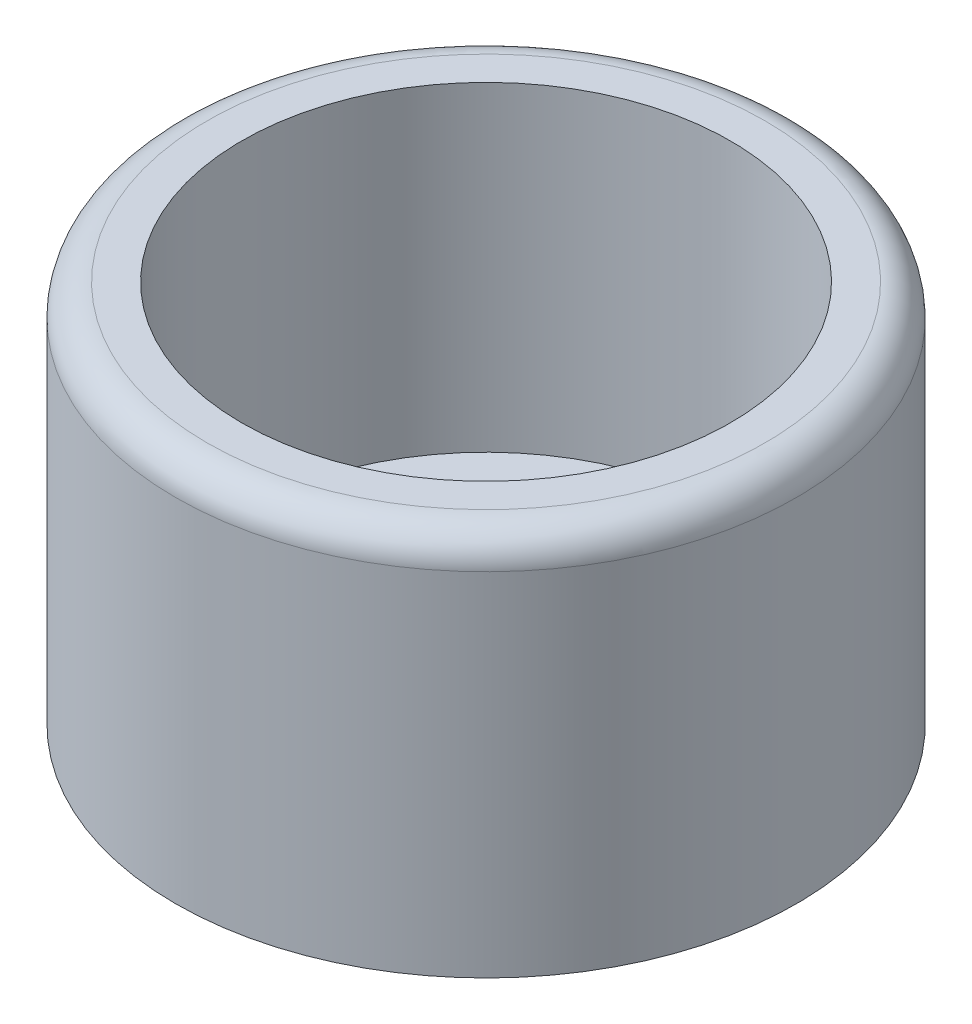
ISO-10303-21;
HEADER;
FILE_DESCRIPTION(('STEP AP214'),'2;1');
FILE_NAME('part.step','',(''),(''),'','','');
FILE_SCHEMA(('AUTOMOTIVE_DESIGN { 1 0 10303 214 1 1 1 1 }'));
ENDSEC;
DATA;
#1=APPLICATION_CONTEXT('core data for automotive mechanical design processes');
#2=APPLICATION_PROTOCOL_DEFINITION('international standard','automotive_design',2000,#1);
#3=PRODUCT_CONTEXT('',#1,'mechanical');
#4=PRODUCT('Part','Part','',(#3));
#5=PRODUCT_RELATED_PRODUCT_CATEGORY('part','',(#4));
#6=PRODUCT_DEFINITION_FORMATION('','',#4);
#7=PRODUCT_DEFINITION_CONTEXT('part definition',#1,'design');
#8=PRODUCT_DEFINITION('design','',#6,#7);
#9=PRODUCT_DEFINITION_SHAPE('','',#8);
#10=(LENGTH_UNIT() NAMED_UNIT(*) SI_UNIT(.MILLI.,.METRE.));
#11=(NAMED_UNIT(*) PLANE_ANGLE_UNIT() SI_UNIT($,.RADIAN.));
#12=(NAMED_UNIT(*) SI_UNIT($,.STERADIAN.) SOLID_ANGLE_UNIT());
#13=UNCERTAINTY_MEASURE_WITH_UNIT(LENGTH_MEASURE(1.E-05),#10,'distance_accuracy_value','');
#14=(GEOMETRIC_REPRESENTATION_CONTEXT(3) GLOBAL_UNCERTAINTY_ASSIGNED_CONTEXT((#13)) GLOBAL_UNIT_ASSIGNED_CONTEXT((#10,
#11,#12)) REPRESENTATION_CONTEXT('',''));
#15=CARTESIAN_POINT('',(0.,0.,0.));
#16=DIRECTION('',(0.,0.,1.));
#17=DIRECTION('',(1.,0.,0.));
#18=AXIS2_PLACEMENT_3D('',#15,#16,#17);
#19=CARTESIAN_POINT('',(0.,6.08,0.));
#20=DIRECTION('',(0.,-1.,0.));
#21=DIRECTION('',(0.,0.,-1.));
#22=AXIS2_PLACEMENT_3D('',#19,#20,#21);
#23=CYLINDRICAL_SURFACE('',#22,4.925);
#24=CARTESIAN_POINT('',(0.,5.58,0.));
#25=DIRECTION('',(0.,1.,0.));
#26=DIRECTION('',(0.,0.,1.));
#27=AXIS2_PLACEMENT_3D('',#24,#25,#26);
#28=CIRCLE('',#27,4.925);
#29=CARTESIAN_POINT('',(0.,5.58,4.925));
#30=VERTEX_POINT('',#29);
#31=EDGE_CURVE('E12',#30,#30,#28,.F.);
#32=ORIENTED_EDGE('',*,*,#31,.T.);
#33=EDGE_LOOP('',(#32));
#34=FACE_BOUND('',#33,.T.);
#35=CARTESIAN_POINT('',(0.,0.,0.));
#36=DIRECTION('',(0.,1.,0.));
#37=DIRECTION('',(0.,0.,1.));
#38=AXIS2_PLACEMENT_3D('',#35,#36,#37);
#39=CIRCLE('',#38,4.925);
#40=CARTESIAN_POINT('',(0.,0.,4.925));
#41=VERTEX_POINT('',#40);
#42=EDGE_CURVE('E233',#41,#41,#39,.T.);
#43=ORIENTED_EDGE('',*,*,#42,.T.);
#44=EDGE_LOOP('',(#43));
#45=FACE_BOUND('',#44,.T.);
#46=ADVANCED_FACE('F36',(#34,#45),#23,.T.);
#47=CARTESIAN_POINT('',(0.,6.08,0.));
#48=DIRECTION('',(0.,1.,0.));
#49=DIRECTION('',(0.,0.,1.));
#50=AXIS2_PLACEMENT_3D('',#47,#48,#49);
#51=PLANE('',#50);
#52=CARTESIAN_POINT('',(0.,6.08,0.));
#53=DIRECTION('',(0.,1.,0.));
#54=DIRECTION('',(0.,0.,1.));
#55=AXIS2_PLACEMENT_3D('',#52,#53,#54);
#56=CIRCLE('',#55,4.425);
#57=CARTESIAN_POINT('',(0.,6.08,4.425));
#58=VERTEX_POINT('',#57);
#59=EDGE_CURVE('E44',#58,#58,#56,.T.);
#60=ORIENTED_EDGE('',*,*,#59,.T.);
#61=EDGE_LOOP('',(#60));
#62=FACE_BOUND('',#61,.T.);
#63=CARTESIAN_POINT('',(0.,6.08,0.));
#64=DIRECTION('',(0.,1.,0.));
#65=DIRECTION('',(0.,0.,1.));
#66=AXIS2_PLACEMENT_3D('',#63,#64,#65);
#67=CIRCLE('',#66,3.875);
#68=CARTESIAN_POINT('',(0.,6.08,3.875));
#69=VERTEX_POINT('',#68);
#70=EDGE_CURVE('E208',#69,#69,#67,.T.);
#71=ORIENTED_EDGE('',*,*,#70,.F.);
#72=EDGE_LOOP('',(#71));
#73=FACE_BOUND('',#72,.T.);
#74=ADVANCED_FACE('F238',(#62,#73),#51,.T.);
#75=CARTESIAN_POINT('',(0.,0.,0.));
#76=DIRECTION('',(0.,1.,0.));
#77=DIRECTION('',(0.,0.,1.));
#78=AXIS2_PLACEMENT_3D('',#75,#76,#77);
#79=PLANE('',#78);
#80=DIRECTION('',(-1.,0.,0.));
#81=VECTOR('',#80,1.);
#82=CARTESIAN_POINT('',(2.875,0.,-0.5));
#83=LINE('',#82,#81);
#84=CARTESIAN_POINT('',(2.875,0.,-0.5));
#85=VERTEX_POINT('',#84);
#86=CARTESIAN_POINT('',(0.5,0.,-0.5));
#87=VERTEX_POINT('',#86);
#88=EDGE_CURVE('E137',#85,#87,#83,.T.);
#89=ORIENTED_EDGE('',*,*,#88,.T.);
#90=DIRECTION('',(0.,0.,-1.));
#91=VECTOR('',#90,1.);
#92=CARTESIAN_POINT('',(0.5,0.,-2.875));
#93=LINE('',#92,#91);
#94=CARTESIAN_POINT('',(0.5,0.,-2.875));
#95=VERTEX_POINT('',#94);
#96=EDGE_CURVE('E129',#87,#95,#93,.T.);
#97=ORIENTED_EDGE('',*,*,#96,.T.);
#98=CARTESIAN_POINT('',(0.,0.,-2.875));
#99=DIRECTION('',(0.,1.,0.));
#100=DIRECTION('',(0.,0.,1.));
#101=AXIS2_PLACEMENT_3D('',#98,#99,#100);
#102=CIRCLE('',#101,0.5);
#103=CARTESIAN_POINT('',(-0.5,0.,-2.875));
#104=VERTEX_POINT('',#103);
#105=EDGE_CURVE('E140',#95,#104,#102,.T.);
#106=ORIENTED_EDGE('',*,*,#105,.T.);
#107=DIRECTION('',(0.,0.,1.));
#108=VECTOR('',#107,1.);
#109=CARTESIAN_POINT('',(-0.5,0.,-2.875));
#110=LINE('',#109,#108);
#111=CARTESIAN_POINT('',(-0.5,0.,-0.5));
#112=VERTEX_POINT('',#111);
#113=EDGE_CURVE('E59',#104,#112,#110,.T.);
#114=ORIENTED_EDGE('',*,*,#113,.T.);
#115=DIRECTION('',(-1.,0.,0.));
#116=VECTOR('',#115,1.);
#117=CARTESIAN_POINT('',(-0.5,0.,-0.5));
#118=LINE('',#117,#116);
#119=CARTESIAN_POINT('',(-2.875,0.,-0.5));
#120=VERTEX_POINT('',#119);
#121=EDGE_CURVE('E154',#112,#120,#118,.T.);
#122=ORIENTED_EDGE('',*,*,#121,.T.);
#123=CARTESIAN_POINT('',(-2.875,0.,0.));
#124=DIRECTION('',(0.,1.,0.));
#125=DIRECTION('',(0.,0.,1.));
#126=AXIS2_PLACEMENT_3D('',#123,#124,#125);
#127=CIRCLE('',#126,0.5);
#128=CARTESIAN_POINT('',(-2.875,0.,0.5));
#129=VERTEX_POINT('',#128);
#130=EDGE_CURVE('E157',#120,#129,#127,.T.);
#131=ORIENTED_EDGE('',*,*,#130,.T.);
#132=DIRECTION('',(1.,0.,0.));
#133=VECTOR('',#132,1.);
#134=CARTESIAN_POINT('',(-0.5,0.,0.5));
#135=LINE('',#134,#133);
#136=CARTESIAN_POINT('',(-0.5,0.,0.5));
#137=VERTEX_POINT('',#136);
#138=EDGE_CURVE('E160',#129,#137,#135,.T.);
#139=ORIENTED_EDGE('',*,*,#138,.T.);
#140=DIRECTION('',(0.,0.,1.));
#141=VECTOR('',#140,1.);
#142=CARTESIAN_POINT('',(-0.5,0.,0.5));
#143=LINE('',#142,#141);
#144=CARTESIAN_POINT('',(-0.5,0.,2.875));
#145=VERTEX_POINT('',#144);
#146=EDGE_CURVE('E163',#137,#145,#143,.T.);
#147=ORIENTED_EDGE('',*,*,#146,.T.);
#148=CARTESIAN_POINT('',(0.,0.,2.875));
#149=DIRECTION('',(0.,1.,0.));
#150=DIRECTION('',(0.,0.,-1.));
#151=AXIS2_PLACEMENT_3D('',#148,#149,#150);
#152=CIRCLE('',#151,0.5);
#153=CARTESIAN_POINT('',(0.5,0.,2.875));
#154=VERTEX_POINT('',#153);
#155=EDGE_CURVE('E166',#145,#154,#152,.T.);
#156=ORIENTED_EDGE('',*,*,#155,.T.);
#157=DIRECTION('',(0.,0.,-1.));
#158=VECTOR('',#157,1.);
#159=CARTESIAN_POINT('',(0.5,0.,0.5));
#160=LINE('',#159,#158);
#161=CARTESIAN_POINT('',(0.5,0.,0.5));
#162=VERTEX_POINT('',#161);
#163=EDGE_CURVE('E169',#154,#162,#160,.T.);
#164=ORIENTED_EDGE('',*,*,#163,.T.);
#165=DIRECTION('',(1.,0.,0.));
#166=VECTOR('',#165,1.);
#167=CARTESIAN_POINT('',(2.875,0.,0.5));
#168=LINE('',#167,#166);
#169=CARTESIAN_POINT('',(2.875,0.,0.5));
#170=VERTEX_POINT('',#169);
#171=EDGE_CURVE('E172',#162,#170,#168,.T.);
#172=ORIENTED_EDGE('',*,*,#171,.T.);
#173=CARTESIAN_POINT('',(2.875,0.,0.));
#174=DIRECTION('',(0.,1.,0.));
#175=DIRECTION('',(0.,0.,1.));
#176=AXIS2_PLACEMENT_3D('',#173,#174,#175);
#177=CIRCLE('',#176,0.5);
#178=EDGE_CURVE('E175',#170,#85,#177,.T.);
#179=ORIENTED_EDGE('',*,*,#178,.T.);
#180=EDGE_LOOP('',(#89,#97,#106,#114,#122,#131,#139,#147,#156,#164,#172,#179));
#181=FACE_BOUND('',#180,.T.);
#182=ORIENTED_EDGE('',*,*,#42,.F.);
#183=EDGE_LOOP('',(#182));
#184=FACE_BOUND('',#183,.T.);
#185=ADVANCED_FACE('F144',(#181,#184),#79,.F.);
#186=CARTESIAN_POINT('',(0.,-10.9601551083915,0.));
#187=DIRECTION('',(0.,1.,0.));
#188=DIRECTION('',(0.,0.,1.));
#189=AXIS2_PLACEMENT_3D('',#186,#187,#188);
#190=CYLINDRICAL_SURFACE('',#189,3.875);
#191=CARTESIAN_POINT('',(0.,0.999999999999999,0.));
#192=DIRECTION('',(0.,1.,0.));
#193=DIRECTION('',(0.,0.,1.));
#194=AXIS2_PLACEMENT_3D('',#191,#192,#193);
#195=CIRCLE('',#194,3.875);
#196=CARTESIAN_POINT('',(0.,0.999999999999999,3.875));
#197=VERTEX_POINT('',#196);
#198=EDGE_CURVE('E230',#197,#197,#195,.F.);
#199=ORIENTED_EDGE('',*,*,#198,.T.);
#200=EDGE_LOOP('',(#199));
#201=FACE_BOUND('',#200,.T.);
#202=ORIENTED_EDGE('',*,*,#70,.T.);
#203=EDGE_LOOP('',(#202));
#204=FACE_BOUND('',#203,.T.);
#205=ADVANCED_FACE('F250',(#201,#204),#190,.F.);
#206=CARTESIAN_POINT('',(0.,1.,0.));
#207=DIRECTION('',(0.,1.,0.));
#208=DIRECTION('',(0.,0.,1.));
#209=AXIS2_PLACEMENT_3D('',#206,#207,#208);
#210=PLANE('',#209);
#211=DIRECTION('',(0.,0.,-1.));
#212=VECTOR('',#211,1.);
#213=CARTESIAN_POINT('',(0.5,1.,-2.875));
#214=LINE('',#213,#212);
#215=CARTESIAN_POINT('',(0.5,1.,-0.5));
#216=VERTEX_POINT('',#215);
#217=CARTESIAN_POINT('',(0.5,1.,-2.875));
#218=VERTEX_POINT('',#217);
#219=EDGE_CURVE('E132',#216,#218,#214,.T.);
#220=ORIENTED_EDGE('',*,*,#219,.F.);
#221=DIRECTION('',(-1.,0.,0.));
#222=VECTOR('',#221,1.);
#223=CARTESIAN_POINT('',(2.875,1.,-0.5));
#224=LINE('',#223,#222);
#225=CARTESIAN_POINT('',(2.875,1.,-0.5));
#226=VERTEX_POINT('',#225);
#227=EDGE_CURVE('E148',#226,#216,#224,.T.);
#228=ORIENTED_EDGE('',*,*,#227,.F.);
#229=CARTESIAN_POINT('',(2.875,1.,0.));
#230=DIRECTION('',(0.,1.,0.));
#231=DIRECTION('',(0.,0.,1.));
#232=AXIS2_PLACEMENT_3D('',#229,#230,#231);
#233=CIRCLE('',#232,0.5);
#234=CARTESIAN_POINT('',(2.875,1.,0.5));
#235=VERTEX_POINT('',#234);
#236=EDGE_CURVE('E51',#235,#226,#233,.T.);
#237=ORIENTED_EDGE('',*,*,#236,.F.);
#238=DIRECTION('',(1.,0.,0.));
#239=VECTOR('',#238,1.);
#240=CARTESIAN_POINT('',(2.875,1.,0.5));
#241=LINE('',#240,#239);
#242=CARTESIAN_POINT('',(0.5,1.,0.5));
#243=VERTEX_POINT('',#242);
#244=EDGE_CURVE('E202',#243,#235,#241,.T.);
#245=ORIENTED_EDGE('',*,*,#244,.F.);
#246=DIRECTION('',(0.,0.,-1.));
#247=VECTOR('',#246,1.);
#248=CARTESIAN_POINT('',(0.5,1.,0.5));
#249=LINE('',#248,#247);
#250=CARTESIAN_POINT('',(0.5,1.,2.875));
#251=VERTEX_POINT('',#250);
#252=EDGE_CURVE('E199',#251,#243,#249,.T.);
#253=ORIENTED_EDGE('',*,*,#252,.F.);
#254=CARTESIAN_POINT('',(0.,1.,2.875));
#255=DIRECTION('',(0.,1.,0.));
#256=DIRECTION('',(0.,0.,-1.));
#257=AXIS2_PLACEMENT_3D('',#254,#255,#256);
#258=CIRCLE('',#257,0.5);
#259=CARTESIAN_POINT('',(-0.5,1.,2.875));
#260=VERTEX_POINT('',#259);
#261=EDGE_CURVE('E196',#260,#251,#258,.T.);
#262=ORIENTED_EDGE('',*,*,#261,.F.);
#263=DIRECTION('',(0.,0.,1.));
#264=VECTOR('',#263,1.);
#265=CARTESIAN_POINT('',(-0.5,1.,0.5));
#266=LINE('',#265,#264);
#267=CARTESIAN_POINT('',(-0.5,1.,0.5));
#268=VERTEX_POINT('',#267);
#269=EDGE_CURVE('E193',#268,#260,#266,.T.);
#270=ORIENTED_EDGE('',*,*,#269,.F.);
#271=DIRECTION('',(1.,0.,0.));
#272=VECTOR('',#271,1.);
#273=CARTESIAN_POINT('',(-0.5,1.,0.5));
#274=LINE('',#273,#272);
#275=CARTESIAN_POINT('',(-2.875,1.,0.5));
#276=VERTEX_POINT('',#275);
#277=EDGE_CURVE('E190',#276,#268,#274,.T.);
#278=ORIENTED_EDGE('',*,*,#277,.F.);
#279=CARTESIAN_POINT('',(-2.875,1.,0.));
#280=DIRECTION('',(0.,1.,0.));
#281=DIRECTION('',(0.,0.,1.));
#282=AXIS2_PLACEMENT_3D('',#279,#280,#281);
#283=CIRCLE('',#282,0.5);
#284=CARTESIAN_POINT('',(-2.875,1.,-0.5));
#285=VERTEX_POINT('',#284);
#286=EDGE_CURVE('E187',#285,#276,#283,.T.);
#287=ORIENTED_EDGE('',*,*,#286,.F.);
#288=DIRECTION('',(-1.,0.,0.));
#289=VECTOR('',#288,1.);
#290=CARTESIAN_POINT('',(-0.5,1.,-0.5));
#291=LINE('',#290,#289);
#292=CARTESIAN_POINT('',(-0.5,1.,-0.5));
#293=VERTEX_POINT('',#292);
#294=EDGE_CURVE('E184',#293,#285,#291,.T.);
#295=ORIENTED_EDGE('',*,*,#294,.F.);
#296=DIRECTION('',(0.,0.,1.));
#297=VECTOR('',#296,1.);
#298=CARTESIAN_POINT('',(-0.5,1.,-2.875));
#299=LINE('',#298,#297);
#300=CARTESIAN_POINT('',(-0.5,1.,-2.875));
#301=VERTEX_POINT('',#300);
#302=EDGE_CURVE('E181',#301,#293,#299,.T.);
#303=ORIENTED_EDGE('',*,*,#302,.F.);
#304=CARTESIAN_POINT('',(0.,1.,-2.875));
#305=DIRECTION('',(0.,1.,0.));
#306=DIRECTION('',(0.,0.,1.));
#307=AXIS2_PLACEMENT_3D('',#304,#305,#306);
#308=CIRCLE('',#307,0.5);
#309=EDGE_CURVE('E179',#218,#301,#308,.T.);
#310=ORIENTED_EDGE('',*,*,#309,.F.);
#311=EDGE_LOOP('',(#220,#228,#237,#245,#253,#262,#270,#278,#287,#295,#303,#310));
#312=FACE_BOUND('',#311,.T.);
#313=ORIENTED_EDGE('',*,*,#198,.F.);
#314=EDGE_LOOP('',(#313));
#315=FACE_BOUND('',#314,.T.);
#316=ADVANCED_FACE('F242',(#312,#315),#210,.T.);
#317=CARTESIAN_POINT('',(0.,5.58,0.));
#318=DIRECTION('',(0.,1.,0.));
#319=DIRECTION('',(0.,0.,1.));
#320=AXIS2_PLACEMENT_3D('',#317,#318,#319);
#321=TOROIDAL_SURFACE('',#320,4.425,0.5);
#322=ORIENTED_EDGE('',*,*,#31,.F.);
#323=EDGE_LOOP('',(#322));
#324=FACE_BOUND('',#323,.T.);
#325=ORIENTED_EDGE('',*,*,#59,.F.);
#326=EDGE_LOOP('',(#325));
#327=FACE_BOUND('',#326,.T.);
#328=ADVANCED_FACE('F38',(#324,#327),#321,.T.);
#329=CARTESIAN_POINT('',(0.5,0.,-2.875));
#330=DIRECTION('',(1.,0.,0.));
#331=DIRECTION('',(0.,0.,-1.));
#332=AXIS2_PLACEMENT_3D('',#329,#330,#331);
#333=PLANE('',#332);
#334=ORIENTED_EDGE('',*,*,#219,.T.);
#335=DIRECTION('',(0.,1.,0.));
#336=VECTOR('',#335,1.);
#337=CARTESIAN_POINT('',(0.5,0.,-2.875));
#338=LINE('',#337,#336);
#339=EDGE_CURVE('E125',#95,#218,#338,.T.);
#340=ORIENTED_EDGE('',*,*,#339,.F.);
#341=ORIENTED_EDGE('',*,*,#96,.F.);
#342=DIRECTION('',(0.,1.,0.));
#343=VECTOR('',#342,1.);
#344=CARTESIAN_POINT('',(0.5,0.,-0.5));
#345=LINE('',#344,#343);
#346=EDGE_CURVE('E206',#87,#216,#345,.T.);
#347=ORIENTED_EDGE('',*,*,#346,.T.);
#348=EDGE_LOOP('',(#334,#340,#341,#347));
#349=FACE_BOUND('',#348,.T.);
#350=ADVANCED_FACE('F127',(#349),#333,.F.);
#351=CARTESIAN_POINT('',(2.875,0.,-0.5));
#352=DIRECTION('',(0.,0.,-1.));
#353=DIRECTION('',(-1.,0.,0.));
#354=AXIS2_PLACEMENT_3D('',#351,#352,#353);
#355=PLANE('',#354);
#356=ORIENTED_EDGE('',*,*,#227,.T.);
#357=ORIENTED_EDGE('',*,*,#346,.F.);
#358=ORIENTED_EDGE('',*,*,#88,.F.);
#359=DIRECTION('',(0.,1.,0.));
#360=VECTOR('',#359,1.);
#361=CARTESIAN_POINT('',(2.875,0.,-0.5));
#362=LINE('',#361,#360);
#363=EDGE_CURVE('E209',#85,#226,#362,.T.);
#364=ORIENTED_EDGE('',*,*,#363,.T.);
#365=EDGE_LOOP('',(#356,#357,#358,#364));
#366=FACE_BOUND('',#365,.T.);
#367=ADVANCED_FACE('F248',(#366),#355,.F.);
#368=CARTESIAN_POINT('',(2.875,0.,0.));
#369=DIRECTION('',(0.,1.,0.));
#370=DIRECTION('',(0.,0.,1.));
#371=AXIS2_PLACEMENT_3D('',#368,#369,#370);
#372=CYLINDRICAL_SURFACE('',#371,0.5);
#373=ORIENTED_EDGE('',*,*,#236,.T.);
#374=ORIENTED_EDGE('',*,*,#363,.F.);
#375=ORIENTED_EDGE('',*,*,#178,.F.);
#376=DIRECTION('',(0.,1.,0.));
#377=VECTOR('',#376,1.);
#378=CARTESIAN_POINT('',(2.875,0.,0.5));
#379=LINE('',#378,#377);
#380=EDGE_CURVE('E211',#170,#235,#379,.T.);
#381=ORIENTED_EDGE('',*,*,#380,.T.);
#382=EDGE_LOOP('',(#373,#374,#375,#381));
#383=FACE_BOUND('',#382,.T.);
#384=ADVANCED_FACE('F299',(#383),#372,.F.);
#385=CARTESIAN_POINT('',(2.875,0.,0.5));
#386=DIRECTION('',(0.,0.,1.));
#387=DIRECTION('',(1.,0.,0.));
#388=AXIS2_PLACEMENT_3D('',#385,#386,#387);
#389=PLANE('',#388);
#390=ORIENTED_EDGE('',*,*,#244,.T.);
#391=ORIENTED_EDGE('',*,*,#380,.F.);
#392=ORIENTED_EDGE('',*,*,#171,.F.);
#393=DIRECTION('',(0.,1.,0.));
#394=VECTOR('',#393,1.);
#395=CARTESIAN_POINT('',(0.5,0.,0.5));
#396=LINE('',#395,#394);
#397=EDGE_CURVE('E213',#162,#243,#396,.T.);
#398=ORIENTED_EDGE('',*,*,#397,.T.);
#399=EDGE_LOOP('',(#390,#391,#392,#398));
#400=FACE_BOUND('',#399,.T.);
#401=ADVANCED_FACE('F295',(#400),#389,.F.);
#402=CARTESIAN_POINT('',(0.5,0.,0.5));
#403=DIRECTION('',(1.,0.,0.));
#404=DIRECTION('',(0.,0.,-1.));
#405=AXIS2_PLACEMENT_3D('',#402,#403,#404);
#406=PLANE('',#405);
#407=ORIENTED_EDGE('',*,*,#252,.T.);
#408=ORIENTED_EDGE('',*,*,#397,.F.);
#409=ORIENTED_EDGE('',*,*,#163,.F.);
#410=DIRECTION('',(0.,1.,0.));
#411=VECTOR('',#410,1.);
#412=CARTESIAN_POINT('',(0.5,0.,2.875));
#413=LINE('',#412,#411);
#414=EDGE_CURVE('E215',#154,#251,#413,.T.);
#415=ORIENTED_EDGE('',*,*,#414,.T.);
#416=EDGE_LOOP('',(#407,#408,#409,#415));
#417=FACE_BOUND('',#416,.T.);
#418=ADVANCED_FACE('F291',(#417),#406,.F.);
#419=CARTESIAN_POINT('',(0.,0.,2.875));
#420=DIRECTION('',(0.,1.,0.));
#421=DIRECTION('',(0.,0.,1.));
#422=AXIS2_PLACEMENT_3D('',#419,#420,#421);
#423=CYLINDRICAL_SURFACE('',#422,0.5);
#424=ORIENTED_EDGE('',*,*,#261,.T.);
#425=ORIENTED_EDGE('',*,*,#414,.F.);
#426=ORIENTED_EDGE('',*,*,#155,.F.);
#427=DIRECTION('',(0.,1.,0.));
#428=VECTOR('',#427,1.);
#429=CARTESIAN_POINT('',(-0.5,0.,2.875));
#430=LINE('',#429,#428);
#431=EDGE_CURVE('E217',#145,#260,#430,.T.);
#432=ORIENTED_EDGE('',*,*,#431,.T.);
#433=EDGE_LOOP('',(#424,#425,#426,#432));
#434=FACE_BOUND('',#433,.T.);
#435=ADVANCED_FACE('F287',(#434),#423,.F.);
#436=CARTESIAN_POINT('',(-0.5,0.,0.5));
#437=DIRECTION('',(-1.,0.,0.));
#438=DIRECTION('',(0.,0.,1.));
#439=AXIS2_PLACEMENT_3D('',#436,#437,#438);
#440=PLANE('',#439);
#441=ORIENTED_EDGE('',*,*,#269,.T.);
#442=ORIENTED_EDGE('',*,*,#431,.F.);
#443=ORIENTED_EDGE('',*,*,#146,.F.);
#444=DIRECTION('',(0.,1.,0.));
#445=VECTOR('',#444,1.);
#446=CARTESIAN_POINT('',(-0.5,0.,0.5));
#447=LINE('',#446,#445);
#448=EDGE_CURVE('E219',#137,#268,#447,.T.);
#449=ORIENTED_EDGE('',*,*,#448,.T.);
#450=EDGE_LOOP('',(#441,#442,#443,#449));
#451=FACE_BOUND('',#450,.T.);
#452=ADVANCED_FACE('F283',(#451),#440,.F.);
#453=CARTESIAN_POINT('',(-0.5,0.,0.5));
#454=DIRECTION('',(0.,0.,1.));
#455=DIRECTION('',(1.,0.,0.));
#456=AXIS2_PLACEMENT_3D('',#453,#454,#455);
#457=PLANE('',#456);
#458=ORIENTED_EDGE('',*,*,#277,.T.);
#459=ORIENTED_EDGE('',*,*,#448,.F.);
#460=ORIENTED_EDGE('',*,*,#138,.F.);
#461=DIRECTION('',(0.,1.,0.));
#462=VECTOR('',#461,1.);
#463=CARTESIAN_POINT('',(-2.875,0.,0.5));
#464=LINE('',#463,#462);
#465=EDGE_CURVE('E221',#129,#276,#464,.T.);
#466=ORIENTED_EDGE('',*,*,#465,.T.);
#467=EDGE_LOOP('',(#458,#459,#460,#466));
#468=FACE_BOUND('',#467,.T.);
#469=ADVANCED_FACE('F279',(#468),#457,.F.);
#470=CARTESIAN_POINT('',(-2.875,0.,0.));
#471=DIRECTION('',(0.,1.,0.));
#472=DIRECTION('',(0.,0.,1.));
#473=AXIS2_PLACEMENT_3D('',#470,#471,#472);
#474=CYLINDRICAL_SURFACE('',#473,0.5);
#475=ORIENTED_EDGE('',*,*,#286,.T.);
#476=ORIENTED_EDGE('',*,*,#465,.F.);
#477=ORIENTED_EDGE('',*,*,#130,.F.);
#478=DIRECTION('',(0.,1.,0.));
#479=VECTOR('',#478,1.);
#480=CARTESIAN_POINT('',(-2.875,0.,-0.5));
#481=LINE('',#480,#479);
#482=EDGE_CURVE('E223',#120,#285,#481,.T.);
#483=ORIENTED_EDGE('',*,*,#482,.T.);
#484=EDGE_LOOP('',(#475,#476,#477,#483));
#485=FACE_BOUND('',#484,.T.);
#486=ADVANCED_FACE('F275',(#485),#474,.F.);
#487=CARTESIAN_POINT('',(-0.5,0.,-0.5));
#488=DIRECTION('',(0.,0.,-1.));
#489=DIRECTION('',(-1.,0.,0.));
#490=AXIS2_PLACEMENT_3D('',#487,#488,#489);
#491=PLANE('',#490);
#492=ORIENTED_EDGE('',*,*,#294,.T.);
#493=ORIENTED_EDGE('',*,*,#482,.F.);
#494=ORIENTED_EDGE('',*,*,#121,.F.);
#495=DIRECTION('',(0.,1.,0.));
#496=VECTOR('',#495,1.);
#497=CARTESIAN_POINT('',(-0.5,0.,-0.5));
#498=LINE('',#497,#496);
#499=EDGE_CURVE('E225',#112,#293,#498,.T.);
#500=ORIENTED_EDGE('',*,*,#499,.T.);
#501=EDGE_LOOP('',(#492,#493,#494,#500));
#502=FACE_BOUND('',#501,.T.);
#503=ADVANCED_FACE('F272',(#502),#491,.F.);
#504=CARTESIAN_POINT('',(-0.5,0.,-2.875));
#505=DIRECTION('',(-1.,0.,0.));
#506=DIRECTION('',(0.,0.,1.));
#507=AXIS2_PLACEMENT_3D('',#504,#505,#506);
#508=PLANE('',#507);
#509=ORIENTED_EDGE('',*,*,#302,.T.);
#510=ORIENTED_EDGE('',*,*,#499,.F.);
#511=ORIENTED_EDGE('',*,*,#113,.F.);
#512=DIRECTION('',(0.,1.,0.));
#513=VECTOR('',#512,1.);
#514=CARTESIAN_POINT('',(-0.5,0.,-2.875));
#515=LINE('',#514,#513);
#516=EDGE_CURVE('E136',#104,#301,#515,.T.);
#517=ORIENTED_EDGE('',*,*,#516,.T.);
#518=EDGE_LOOP('',(#509,#510,#511,#517));
#519=FACE_BOUND('',#518,.T.);
#520=ADVANCED_FACE('F269',(#519),#508,.F.);
#521=CARTESIAN_POINT('',(0.,0.,-2.875));
#522=DIRECTION('',(0.,1.,0.));
#523=DIRECTION('',(0.,0.,1.));
#524=AXIS2_PLACEMENT_3D('',#521,#522,#523);
#525=CYLINDRICAL_SURFACE('',#524,0.5);
#526=ORIENTED_EDGE('',*,*,#309,.T.);
#527=ORIENTED_EDGE('',*,*,#516,.F.);
#528=ORIENTED_EDGE('',*,*,#105,.F.);
#529=ORIENTED_EDGE('',*,*,#339,.T.);
#530=EDGE_LOOP('',(#526,#527,#528,#529));
#531=FACE_BOUND('',#530,.T.);
#532=ADVANCED_FACE('F141',(#531),#525,.F.);
#533=CLOSED_SHELL('',(#46,#74,#185,#205,#316,#328,#350,#367,#384,#401,#418,#435,#452,#469,#486,
#503,#520,#532));
#534=MANIFOLD_SOLID_BREP('B2',#533);
#535=ADVANCED_BREP_SHAPE_REPRESENTATION('',(#18,#534),#14);
#536=SHAPE_DEFINITION_REPRESENTATION(#9,#535);
ENDSEC;
END-ISO-10303-21;
